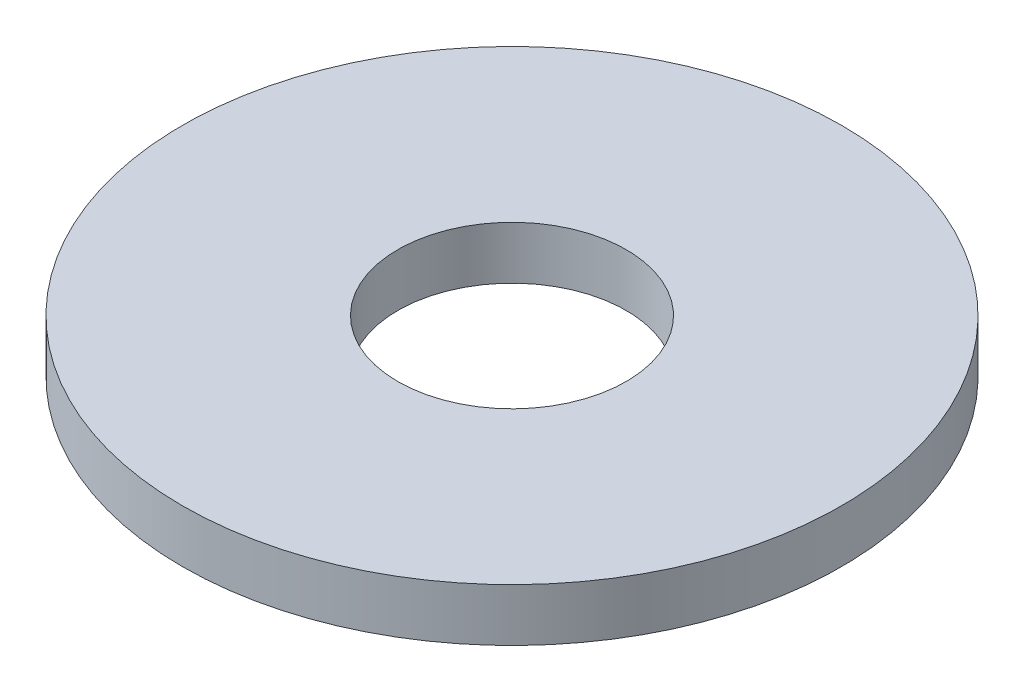
ISO-10303-21;
HEADER;
FILE_DESCRIPTION(('STEP AP214'),'2;1');
FILE_NAME('part.step','',(''),(''),'','','');
FILE_SCHEMA(('AUTOMOTIVE_DESIGN { 1 0 10303 214 1 1 1 1 }'));
ENDSEC;
DATA;
#1=APPLICATION_CONTEXT('core data for automotive mechanical design processes');
#2=APPLICATION_PROTOCOL_DEFINITION('international standard','automotive_design',2000,#1);
#3=PRODUCT_CONTEXT('',#1,'mechanical');
#4=PRODUCT('Part','Part','',(#3));
#5=PRODUCT_RELATED_PRODUCT_CATEGORY('part','',(#4));
#6=PRODUCT_DEFINITION_FORMATION('','',#4);
#7=PRODUCT_DEFINITION_CONTEXT('part definition',#1,'design');
#8=PRODUCT_DEFINITION('design','',#6,#7);
#9=PRODUCT_DEFINITION_SHAPE('','',#8);
#10=(LENGTH_UNIT() NAMED_UNIT(*) SI_UNIT(.MILLI.,.METRE.));
#11=(NAMED_UNIT(*) PLANE_ANGLE_UNIT() SI_UNIT($,.RADIAN.));
#12=(NAMED_UNIT(*) SI_UNIT($,.STERADIAN.) SOLID_ANGLE_UNIT());
#13=UNCERTAINTY_MEASURE_WITH_UNIT(LENGTH_MEASURE(1.E-05),#10,'distance_accuracy_value','');
#14=(GEOMETRIC_REPRESENTATION_CONTEXT(3) GLOBAL_UNCERTAINTY_ASSIGNED_CONTEXT((#13)) GLOBAL_UNIT_ASSIGNED_CONTEXT((#10,
#11,#12)) REPRESENTATION_CONTEXT('',''));
#15=CARTESIAN_POINT('',(0.,0.,0.));
#16=DIRECTION('',(0.,0.,1.));
#17=DIRECTION('',(1.,0.,0.));
#18=AXIS2_PLACEMENT_3D('',#15,#16,#17);
#19=CARTESIAN_POINT('',(0.,1.2,0.));
#20=DIRECTION('',(0.,1.,0.));
#21=DIRECTION('',(0.,0.,1.));
#22=AXIS2_PLACEMENT_3D('',#19,#20,#21);
#23=PLANE('',#22);
#24=CARTESIAN_POINT('',(0.,1.2,0.));
#25=DIRECTION('',(0.,1.,0.));
#26=DIRECTION('',(0.,0.,1.));
#27=AXIS2_PLACEMENT_3D('',#24,#25,#26);
#28=CIRCLE('',#27,7.5);
#29=CARTESIAN_POINT('',(0.,1.2,7.5));
#30=VERTEX_POINT('',#29);
#31=EDGE_CURVE('E10',#30,#30,#28,.T.);
#32=ORIENTED_EDGE('',*,*,#31,.T.);
#33=EDGE_LOOP('',(#32));
#34=FACE_BOUND('',#33,.T.);
#35=CARTESIAN_POINT('',(0.,1.2,0.));
#36=DIRECTION('',(0.,1.,0.));
#37=DIRECTION('',(0.,0.,1.));
#38=AXIS2_PLACEMENT_3D('',#35,#36,#37);
#39=CIRCLE('',#38,2.6);
#40=CARTESIAN_POINT('',(0.,1.2,2.6));
#41=VERTEX_POINT('',#40);
#42=EDGE_CURVE('E46',#41,#41,#39,.T.);
#43=ORIENTED_EDGE('',*,*,#42,.F.);
#44=EDGE_LOOP('',(#43));
#45=FACE_BOUND('',#44,.T.);
#46=ADVANCED_FACE('F35',(#34,#45),#23,.T.);
#47=CARTESIAN_POINT('',(0.,0.,0.));
#48=DIRECTION('',(0.,1.,0.));
#49=DIRECTION('',(0.,0.,1.));
#50=AXIS2_PLACEMENT_3D('',#47,#48,#49);
#51=PLANE('',#50);
#52=CARTESIAN_POINT('',(0.,0.,0.));
#53=DIRECTION('',(0.,1.,0.));
#54=DIRECTION('',(0.,0.,1.));
#55=AXIS2_PLACEMENT_3D('',#52,#53,#54);
#56=CIRCLE('',#55,7.5);
#57=CARTESIAN_POINT('',(0.,0.,7.5));
#58=VERTEX_POINT('',#57);
#59=EDGE_CURVE('E39',#58,#58,#56,.T.);
#60=ORIENTED_EDGE('',*,*,#59,.F.);
#61=EDGE_LOOP('',(#60));
#62=FACE_BOUND('',#61,.T.);
#63=CARTESIAN_POINT('',(0.,0.,0.));
#64=DIRECTION('',(0.,1.,0.));
#65=DIRECTION('',(0.,0.,1.));
#66=AXIS2_PLACEMENT_3D('',#63,#64,#65);
#67=CIRCLE('',#66,2.6);
#68=CARTESIAN_POINT('',(0.,0.,2.6));
#69=VERTEX_POINT('',#68);
#70=EDGE_CURVE('E48',#69,#69,#67,.T.);
#71=ORIENTED_EDGE('',*,*,#70,.T.);
#72=EDGE_LOOP('',(#71));
#73=FACE_BOUND('',#72,.T.);
#74=ADVANCED_FACE('F58',(#62,#73),#51,.F.);
#75=CARTESIAN_POINT('',(0.,1.2,0.));
#76=DIRECTION('',(0.,-1.,0.));
#77=DIRECTION('',(0.,0.,-1.));
#78=AXIS2_PLACEMENT_3D('',#75,#76,#77);
#79=CYLINDRICAL_SURFACE('',#78,7.5);
#80=ORIENTED_EDGE('',*,*,#31,.F.);
#81=EDGE_LOOP('',(#80));
#82=FACE_BOUND('',#81,.T.);
#83=ORIENTED_EDGE('',*,*,#59,.T.);
#84=EDGE_LOOP('',(#83));
#85=FACE_BOUND('',#84,.T.);
#86=ADVANCED_FACE('F37',(#82,#85),#79,.T.);
#87=CARTESIAN_POINT('',(0.,1.2,0.));
#88=DIRECTION('',(0.,-1.,0.));
#89=DIRECTION('',(0.,0.,-1.));
#90=AXIS2_PLACEMENT_3D('',#87,#88,#89);
#91=CYLINDRICAL_SURFACE('',#90,2.6);
#92=ORIENTED_EDGE('',*,*,#42,.T.);
#93=EDGE_LOOP('',(#92));
#94=FACE_BOUND('',#93,.T.);
#95=ORIENTED_EDGE('',*,*,#70,.F.);
#96=EDGE_LOOP('',(#95));
#97=FACE_BOUND('',#96,.T.);
#98=ADVANCED_FACE('F54',(#94,#97),#91,.F.);
#99=CLOSED_SHELL('',(#46,#74,#86,#98));
#100=MANIFOLD_SOLID_BREP('B2',#99);
#101=ADVANCED_BREP_SHAPE_REPRESENTATION('',(#18,#100),#14);
#102=SHAPE_DEFINITION_REPRESENTATION(#9,#101);
ENDSEC;
END-ISO-10303-21;
